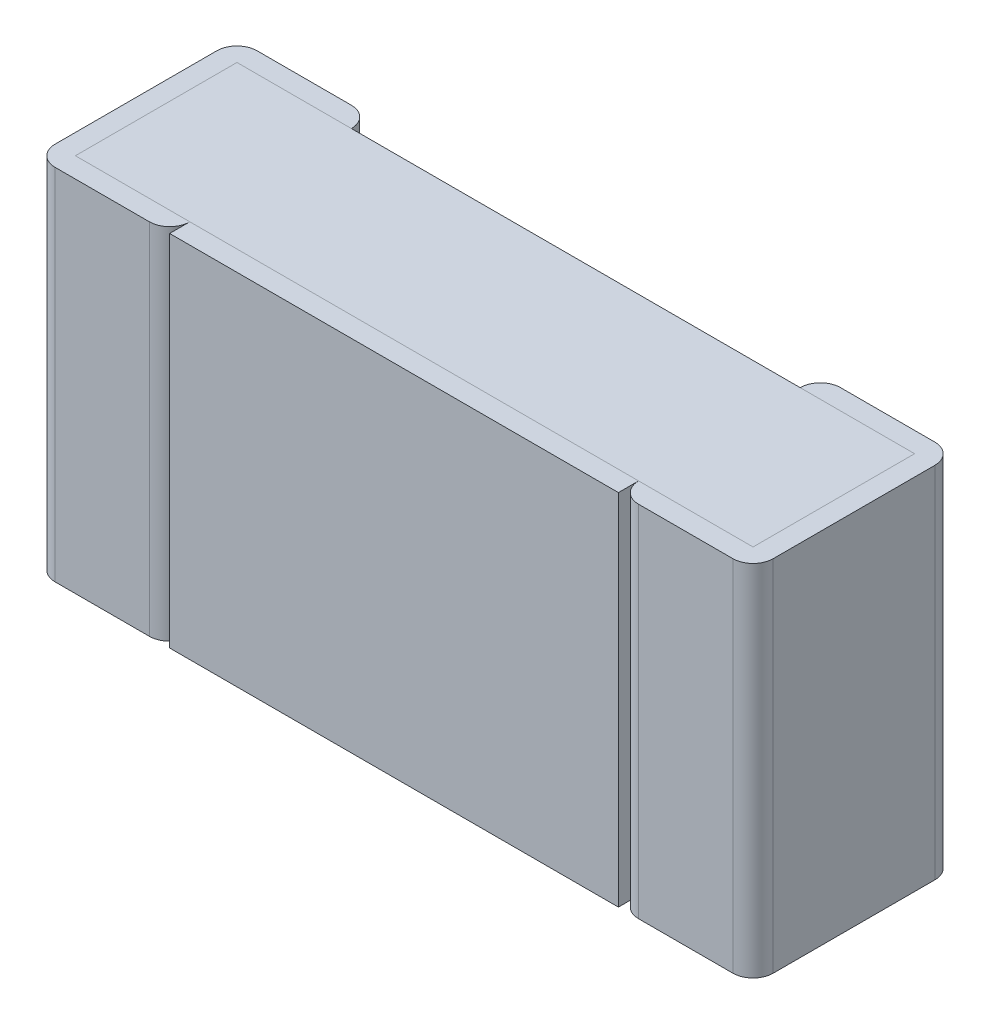
ISO-10303-21;
HEADER;
FILE_DESCRIPTION(('STEP AP214'),'2;1');
FILE_NAME('part.step','',(''),(''),'','','');
FILE_SCHEMA(('AUTOMOTIVE_DESIGN { 1 0 10303 214 1 1 1 1 }'));
ENDSEC;
DATA;
#1=APPLICATION_CONTEXT('core data for automotive mechanical design processes');
#2=APPLICATION_PROTOCOL_DEFINITION('international standard','automotive_design',2000,#1);
#3=PRODUCT_CONTEXT('',#1,'mechanical');
#4=PRODUCT('Part','Part','',(#3));
#5=PRODUCT_RELATED_PRODUCT_CATEGORY('part','',(#4));
#6=PRODUCT_DEFINITION_FORMATION('','',#4);
#7=PRODUCT_DEFINITION_CONTEXT('part definition',#1,'design');
#8=PRODUCT_DEFINITION('design','',#6,#7);
#9=PRODUCT_DEFINITION_SHAPE('','',#8);
#10=(LENGTH_UNIT() NAMED_UNIT(*) SI_UNIT(.MILLI.,.METRE.));
#11=(NAMED_UNIT(*) PLANE_ANGLE_UNIT() SI_UNIT($,.RADIAN.));
#12=(NAMED_UNIT(*) SI_UNIT($,.STERADIAN.) SOLID_ANGLE_UNIT());
#13=UNCERTAINTY_MEASURE_WITH_UNIT(LENGTH_MEASURE(1.E-05),#10,'distance_accuracy_value','');
#14=(GEOMETRIC_REPRESENTATION_CONTEXT(3) GLOBAL_UNCERTAINTY_ASSIGNED_CONTEXT((#13)) GLOBAL_UNIT_ASSIGNED_CONTEXT((#10,
#11,#12)) REPRESENTATION_CONTEXT('',''));
#15=CARTESIAN_POINT('',(0.,0.,0.));
#16=DIRECTION('',(0.,0.,1.));
#17=DIRECTION('',(1.,0.,0.));
#18=AXIS2_PLACEMENT_3D('',#15,#16,#17);
#19=CARTESIAN_POINT('',(-0.5,-0.4,0.45));
#20=DIRECTION('',(0.,0.,1.));
#21=DIRECTION('',(1.,0.,0.));
#22=AXIS2_PLACEMENT_3D('',#19,#20,#21);
#23=PLANE('',#22);
#24=DIRECTION('',(0.,1.,0.));
#25=VECTOR('',#24,1.);
#26=CARTESIAN_POINT('',(-0.5,-0.4,0.45));
#27=LINE('',#26,#25);
#28=CARTESIAN_POINT('',(-0.5,-0.4,0.45));
#29=VERTEX_POINT('',#28);
#30=CARTESIAN_POINT('',(-0.5,0.4,0.45));
#31=VERTEX_POINT('',#30);
#32=EDGE_CURVE('E294',#29,#31,#27,.T.);
#33=ORIENTED_EDGE('',*,*,#32,.F.);
#34=DIRECTION('',(1.,0.,0.));
#35=VECTOR('',#34,1.);
#36=CARTESIAN_POINT('',(-0.5,-0.4,0.45));
#37=LINE('',#36,#35);
#38=CARTESIAN_POINT('',(0.5,-0.4,0.45));
#39=VERTEX_POINT('',#38);
#40=EDGE_CURVE('E295',#29,#39,#37,.T.);
#41=ORIENTED_EDGE('',*,*,#40,.T.);
#42=DIRECTION('',(0.,1.,0.));
#43=VECTOR('',#42,1.);
#44=CARTESIAN_POINT('',(0.5,-0.4,0.45));
#45=LINE('',#44,#43);
#46=CARTESIAN_POINT('',(0.5,0.4,0.45));
#47=VERTEX_POINT('',#46);
#48=EDGE_CURVE('E11',#39,#47,#45,.T.);
#49=ORIENTED_EDGE('',*,*,#48,.T.);
#50=DIRECTION('',(1.,0.,0.));
#51=VECTOR('',#50,1.);
#52=CARTESIAN_POINT('',(-0.5,0.4,0.45));
#53=LINE('',#52,#51);
#54=EDGE_CURVE('E249',#31,#47,#53,.T.);
#55=ORIENTED_EDGE('',*,*,#54,.F.);
#56=EDGE_LOOP('',(#33,#41,#49,#55));
#57=FACE_BOUND('',#56,.T.);
#58=ADVANCED_FACE('F16',(#57),#23,.T.);
#59=CARTESIAN_POINT('',(0.5,-0.4,0.405));
#60=DIRECTION('',(1.,0.,0.));
#61=DIRECTION('',(0.,1.,0.));
#62=AXIS2_PLACEMENT_3D('',#59,#60,#61);
#63=PLANE('',#62);
#64=DIRECTION('',(0.,0.,1.));
#65=VECTOR('',#64,1.);
#66=CARTESIAN_POINT('',(0.5,-0.4,0.405));
#67=LINE('',#66,#65);
#68=CARTESIAN_POINT('',(0.5,-0.4,0.405));
#69=VERTEX_POINT('',#68);
#70=EDGE_CURVE('E279',#69,#39,#67,.T.);
#71=ORIENTED_EDGE('',*,*,#70,.F.);
#72=DIRECTION('',(0.,1.,0.));
#73=VECTOR('',#72,1.);
#74=CARTESIAN_POINT('',(0.5,-0.4,0.405));
#75=LINE('',#74,#73);
#76=CARTESIAN_POINT('',(0.5,0.4,0.405));
#77=VERTEX_POINT('',#76);
#78=EDGE_CURVE('E27',#69,#77,#75,.T.);
#79=ORIENTED_EDGE('',*,*,#78,.T.);
#80=DIRECTION('',(0.,0.,1.));
#81=VECTOR('',#80,1.);
#82=CARTESIAN_POINT('',(0.5,0.4,0.405));
#83=LINE('',#82,#81);
#84=EDGE_CURVE('E252',#77,#47,#83,.T.);
#85=ORIENTED_EDGE('',*,*,#84,.T.);
#86=ORIENTED_EDGE('',*,*,#48,.F.);
#87=EDGE_LOOP('',(#71,#79,#85,#86));
#88=FACE_BOUND('',#87,.T.);
#89=ADVANCED_FACE('F509',(#88),#63,.T.);
#90=CARTESIAN_POINT('',(0.545,-0.4,0.405));
#91=DIRECTION('',(0.,1.,0.));
#92=DIRECTION('',(-1.,0.,0.));
#93=AXIS2_PLACEMENT_3D('',#90,#91,#92);
#94=CYLINDRICAL_SURFACE('',#93,0.045);
#95=CARTESIAN_POINT('',(0.545,-0.4,0.405));
#96=DIRECTION('',(0.,1.,0.));
#97=DIRECTION('',(0.,0.,1.));
#98=AXIS2_PLACEMENT_3D('',#95,#96,#97);
#99=CIRCLE('',#98,0.045);
#100=CARTESIAN_POINT('',(0.545,-0.4,0.45));
#101=VERTEX_POINT('',#100);
#102=EDGE_CURVE('E398',#69,#101,#99,.T.);
#103=ORIENTED_EDGE('',*,*,#102,.T.);
#104=DIRECTION('',(0.,1.,0.));
#105=VECTOR('',#104,1.);
#106=CARTESIAN_POINT('',(0.545,-0.4,0.45));
#107=LINE('',#106,#105);
#108=CARTESIAN_POINT('',(0.545,0.4,0.45));
#109=VERTEX_POINT('',#108);
#110=EDGE_CURVE('E244',#101,#109,#107,.T.);
#111=ORIENTED_EDGE('',*,*,#110,.T.);
#112=CARTESIAN_POINT('',(0.545,0.4,0.405));
#113=DIRECTION('',(0.,1.,0.));
#114=DIRECTION('',(0.,0.,1.));
#115=AXIS2_PLACEMENT_3D('',#112,#113,#114);
#116=CIRCLE('',#115,0.045);
#117=EDGE_CURVE('E347',#77,#109,#116,.T.);
#118=ORIENTED_EDGE('',*,*,#117,.F.);
#119=ORIENTED_EDGE('',*,*,#78,.F.);
#120=EDGE_LOOP('',(#103,#111,#118,#119));
#121=FACE_BOUND('',#120,.T.);
#122=ADVANCED_FACE('F515',(#121),#94,.T.);
#123=CARTESIAN_POINT('',(0.5,-0.4,0.45));
#124=DIRECTION('',(0.,0.,1.));
#125=DIRECTION('',(1.,0.,0.));
#126=AXIS2_PLACEMENT_3D('',#123,#124,#125);
#127=PLANE('',#126);
#128=DIRECTION('',(1.,0.,0.));
#129=VECTOR('',#128,1.);
#130=CARTESIAN_POINT('',(0.5,0.4,0.45));
#131=LINE('',#130,#129);
#132=CARTESIAN_POINT('',(0.755,0.4,0.45));
#133=VERTEX_POINT('',#132);
#134=EDGE_CURVE('E362',#109,#133,#131,.T.);
#135=ORIENTED_EDGE('',*,*,#134,.F.);
#136=ORIENTED_EDGE('',*,*,#110,.F.);
#137=DIRECTION('',(1.,0.,0.));
#138=VECTOR('',#137,1.);
#139=CARTESIAN_POINT('',(0.5,-0.4,0.45));
#140=LINE('',#139,#138);
#141=CARTESIAN_POINT('',(0.755,-0.4,0.45));
#142=VERTEX_POINT('',#141);
#143=EDGE_CURVE('E394',#101,#142,#140,.T.);
#144=ORIENTED_EDGE('',*,*,#143,.T.);
#145=DIRECTION('',(0.,1.,0.));
#146=VECTOR('',#145,1.);
#147=CARTESIAN_POINT('',(0.755,-0.4,0.45));
#148=LINE('',#147,#146);
#149=EDGE_CURVE('E383',#142,#133,#148,.T.);
#150=ORIENTED_EDGE('',*,*,#149,.T.);
#151=EDGE_LOOP('',(#135,#136,#144,#150));
#152=FACE_BOUND('',#151,.T.);
#153=ADVANCED_FACE('F619',(#152),#127,.T.);
#154=CARTESIAN_POINT('',(0.755,-0.4,0.405));
#155=DIRECTION('',(0.,1.,0.));
#156=DIRECTION('',(1.,0.,0.));
#157=AXIS2_PLACEMENT_3D('',#154,#155,#156);
#158=CYLINDRICAL_SURFACE('',#157,0.045);
#159=DIRECTION('',(0.,1.,0.));
#160=VECTOR('',#159,1.);
#161=CARTESIAN_POINT('',(0.8,-0.4,0.405));
#162=LINE('',#161,#160);
#163=CARTESIAN_POINT('',(0.8,-0.4,0.405));
#164=VERTEX_POINT('',#163);
#165=CARTESIAN_POINT('',(0.8,0.4,0.405));
#166=VERTEX_POINT('',#165);
#167=EDGE_CURVE('E283',#164,#166,#162,.T.);
#168=ORIENTED_EDGE('',*,*,#167,.T.);
#169=CARTESIAN_POINT('',(0.755,0.4,0.405));
#170=DIRECTION('',(0.,-1.,0.));
#171=DIRECTION('',(0.,0.,1.));
#172=AXIS2_PLACEMENT_3D('',#169,#170,#171);
#173=CIRCLE('',#172,0.045);
#174=EDGE_CURVE('E275',#166,#133,#173,.T.);
#175=ORIENTED_EDGE('',*,*,#174,.T.);
#176=ORIENTED_EDGE('',*,*,#149,.F.);
#177=CARTESIAN_POINT('',(0.755,-0.4,0.405));
#178=DIRECTION('',(0.,-1.,0.));
#179=DIRECTION('',(0.,0.,1.));
#180=AXIS2_PLACEMENT_3D('',#177,#178,#179);
#181=CIRCLE('',#180,0.045);
#182=EDGE_CURVE('E327',#164,#142,#181,.T.);
#183=ORIENTED_EDGE('',*,*,#182,.F.);
#184=EDGE_LOOP('',(#168,#175,#176,#183));
#185=FACE_BOUND('',#184,.T.);
#186=ADVANCED_FACE('F614',(#185),#158,.T.);
#187=CARTESIAN_POINT('',(0.8,-0.4,0.));
#188=DIRECTION('',(1.,0.,0.));
#189=DIRECTION('',(0.,1.,0.));
#190=AXIS2_PLACEMENT_3D('',#187,#188,#189);
#191=PLANE('',#190);
#192=DIRECTION('',(0.,0.,1.));
#193=VECTOR('',#192,1.);
#194=CARTESIAN_POINT('',(0.8,-0.4,0.));
#195=LINE('',#194,#193);
#196=CARTESIAN_POINT('',(0.8,-0.4,0.045));
#197=VERTEX_POINT('',#196);
#198=EDGE_CURVE('E323',#197,#164,#195,.T.);
#199=ORIENTED_EDGE('',*,*,#198,.F.);
#200=DIRECTION('',(0.,1.,0.));
#201=VECTOR('',#200,1.);
#202=CARTESIAN_POINT('',(0.8,-0.4,0.045));
#203=LINE('',#202,#201);
#204=CARTESIAN_POINT('',(0.8,0.4,0.045));
#205=VERTEX_POINT('',#204);
#206=EDGE_CURVE('E281',#197,#205,#203,.T.);
#207=ORIENTED_EDGE('',*,*,#206,.T.);
#208=DIRECTION('',(0.,0.,1.));
#209=VECTOR('',#208,1.);
#210=CARTESIAN_POINT('',(0.8,0.4,0.));
#211=LINE('',#210,#209);
#212=EDGE_CURVE('E263',#205,#166,#211,.T.);
#213=ORIENTED_EDGE('',*,*,#212,.T.);
#214=ORIENTED_EDGE('',*,*,#167,.F.);
#215=EDGE_LOOP('',(#199,#207,#213,#214));
#216=FACE_BOUND('',#215,.T.);
#217=ADVANCED_FACE('F563',(#216),#191,.T.);
#218=CARTESIAN_POINT('',(0.755,-0.4,0.045));
#219=DIRECTION('',(0.,1.,0.));
#220=DIRECTION('',(1.,0.,0.));
#221=AXIS2_PLACEMENT_3D('',#218,#219,#220);
#222=CYLINDRICAL_SURFACE('',#221,0.045);
#223=CARTESIAN_POINT('',(0.755,-0.4,0.045));
#224=DIRECTION('',(0.,1.,0.));
#225=DIRECTION('',(0.,0.,1.));
#226=AXIS2_PLACEMENT_3D('',#223,#224,#225);
#227=CIRCLE('',#226,0.045);
#228=CARTESIAN_POINT('',(0.755,-0.4,0.));
#229=VERTEX_POINT('',#228);
#230=EDGE_CURVE('E322',#197,#229,#227,.T.);
#231=ORIENTED_EDGE('',*,*,#230,.T.);
#232=DIRECTION('',(0.,1.,0.));
#233=VECTOR('',#232,1.);
#234=CARTESIAN_POINT('',(0.755,-0.4,0.));
#235=LINE('',#234,#233);
#236=CARTESIAN_POINT('',(0.755,0.4,0.));
#237=VERTEX_POINT('',#236);
#238=EDGE_CURVE('E284',#229,#237,#235,.T.);
#239=ORIENTED_EDGE('',*,*,#238,.T.);
#240=CARTESIAN_POINT('',(0.755,0.4,0.045));
#241=DIRECTION('',(0.,1.,0.));
#242=DIRECTION('',(0.,0.,1.));
#243=AXIS2_PLACEMENT_3D('',#240,#241,#242);
#244=CIRCLE('',#243,0.045);
#245=EDGE_CURVE('E253',#205,#237,#244,.T.);
#246=ORIENTED_EDGE('',*,*,#245,.F.);
#247=ORIENTED_EDGE('',*,*,#206,.F.);
#248=EDGE_LOOP('',(#231,#239,#246,#247));
#249=FACE_BOUND('',#248,.T.);
#250=ADVANCED_FACE('F558',(#249),#222,.T.);
#251=CARTESIAN_POINT('',(0.5,-0.4,0.));
#252=DIRECTION('',(0.,0.,1.));
#253=DIRECTION('',(1.,0.,0.));
#254=AXIS2_PLACEMENT_3D('',#251,#252,#253);
#255=PLANE('',#254);
#256=ORIENTED_EDGE('',*,*,#238,.F.);
#257=DIRECTION('',(1.,0.,0.));
#258=VECTOR('',#257,1.);
#259=CARTESIAN_POINT('',(0.5,-0.4,0.));
#260=LINE('',#259,#258);
#261=CARTESIAN_POINT('',(0.545,-0.4,0.));
#262=VERTEX_POINT('',#261);
#263=EDGE_CURVE('E378',#262,#229,#260,.T.);
#264=ORIENTED_EDGE('',*,*,#263,.F.);
#265=DIRECTION('',(0.,1.,0.));
#266=VECTOR('',#265,1.);
#267=CARTESIAN_POINT('',(0.545,-0.4,0.));
#268=LINE('',#267,#266);
#269=CARTESIAN_POINT('',(0.545,0.4,0.));
#270=VERTEX_POINT('',#269);
#271=EDGE_CURVE('E260',#262,#270,#268,.T.);
#272=ORIENTED_EDGE('',*,*,#271,.T.);
#273=DIRECTION('',(1.,0.,0.));
#274=VECTOR('',#273,1.);
#275=CARTESIAN_POINT('',(0.5,0.4,0.));
#276=LINE('',#275,#274);
#277=EDGE_CURVE('E317',#270,#237,#276,.T.);
#278=ORIENTED_EDGE('',*,*,#277,.T.);
#279=EDGE_LOOP('',(#256,#264,#272,#278));
#280=FACE_BOUND('',#279,.T.);
#281=ADVANCED_FACE('F540',(#280),#255,.F.);
#282=CARTESIAN_POINT('',(0.545,-0.4,0.045));
#283=DIRECTION('',(0.,1.,0.));
#284=DIRECTION('',(-1.,0.,0.));
#285=AXIS2_PLACEMENT_3D('',#282,#283,#284);
#286=CYLINDRICAL_SURFACE('',#285,0.045);
#287=DIRECTION('',(0.,1.,0.));
#288=VECTOR('',#287,1.);
#289=CARTESIAN_POINT('',(0.5,-0.4,0.045));
#290=LINE('',#289,#288);
#291=CARTESIAN_POINT('',(0.5,-0.4,0.045));
#292=VERTEX_POINT('',#291);
#293=CARTESIAN_POINT('',(0.5,0.4,0.045));
#294=VERTEX_POINT('',#293);
#295=EDGE_CURVE('E318',#292,#294,#290,.T.);
#296=ORIENTED_EDGE('',*,*,#295,.T.);
#297=CARTESIAN_POINT('',(0.545,0.4,0.045));
#298=DIRECTION('',(0.,-1.,0.));
#299=DIRECTION('',(0.,0.,1.));
#300=AXIS2_PLACEMENT_3D('',#297,#298,#299);
#301=CIRCLE('',#300,0.045);
#302=EDGE_CURVE('E343',#294,#270,#301,.T.);
#303=ORIENTED_EDGE('',*,*,#302,.T.);
#304=ORIENTED_EDGE('',*,*,#271,.F.);
#305=CARTESIAN_POINT('',(0.545,-0.4,0.045));
#306=DIRECTION('',(0.,-1.,0.));
#307=DIRECTION('',(0.,0.,1.));
#308=AXIS2_PLACEMENT_3D('',#305,#306,#307);
#309=CIRCLE('',#308,0.045);
#310=EDGE_CURVE('E382',#292,#262,#309,.T.);
#311=ORIENTED_EDGE('',*,*,#310,.F.);
#312=EDGE_LOOP('',(#296,#303,#304,#311));
#313=FACE_BOUND('',#312,.T.);
#314=ADVANCED_FACE('F535',(#313),#286,.T.);
#315=CARTESIAN_POINT('',(-0.5,0.4,0.405));
#316=DIRECTION('',(0.,1.,0.));
#317=DIRECTION('',(1.,0.,0.));
#318=AXIS2_PLACEMENT_3D('',#315,#316,#317);
#319=PLANE('',#318);
#320=DIRECTION('',(1.,0.,0.));
#321=VECTOR('',#320,1.);
#322=CARTESIAN_POINT('',(-0.5,0.4,0.405));
#323=LINE('',#322,#321);
#324=CARTESIAN_POINT('',(-0.5,0.4,0.405));
#325=VERTEX_POINT('',#324);
#326=EDGE_CURVE('E20',#325,#77,#323,.T.);
#327=ORIENTED_EDGE('',*,*,#326,.F.);
#328=DIRECTION('',(0.,0.,1.));
#329=VECTOR('',#328,1.);
#330=CARTESIAN_POINT('',(-0.5,0.4,0.405));
#331=LINE('',#330,#329);
#332=EDGE_CURVE('E314',#325,#31,#331,.T.);
#333=ORIENTED_EDGE('',*,*,#332,.T.);
#334=ORIENTED_EDGE('',*,*,#54,.T.);
#335=ORIENTED_EDGE('',*,*,#84,.F.);
#336=EDGE_LOOP('',(#327,#333,#334,#335));
#337=FACE_BOUND('',#336,.T.);
#338=ADVANCED_FACE('F484',(#337),#319,.T.);
#339=CARTESIAN_POINT('',(0.5,0.4,0.));
#340=DIRECTION('',(0.,1.,0.));
#341=DIRECTION('',(1.,0.,0.));
#342=AXIS2_PLACEMENT_3D('',#339,#340,#341);
#343=PLANE('',#342);
#344=ORIENTED_EDGE('',*,*,#277,.F.);
#345=ORIENTED_EDGE('',*,*,#302,.F.);
#346=DIRECTION('',(1.,0.,0.));
#347=VECTOR('',#346,1.);
#348=CARTESIAN_POINT('',(-0.755,0.4,0.045));
#349=LINE('',#348,#347);
#350=CARTESIAN_POINT('',(0.755,0.4,0.045));
#351=VERTEX_POINT('',#350);
#352=EDGE_CURVE('E235',#294,#351,#349,.T.);
#353=ORIENTED_EDGE('',*,*,#352,.T.);
#354=DIRECTION('',(0.,0.,1.));
#355=VECTOR('',#354,1.);
#356=CARTESIAN_POINT('',(0.755,0.4,0.045));
#357=LINE('',#356,#355);
#358=CARTESIAN_POINT('',(0.755,0.4,0.405));
#359=VERTEX_POINT('',#358);
#360=EDGE_CURVE('E390',#351,#359,#357,.T.);
#361=ORIENTED_EDGE('',*,*,#360,.T.);
#362=DIRECTION('',(1.,0.,0.));
#363=VECTOR('',#362,1.);
#364=CARTESIAN_POINT('',(-0.755,0.4,0.405));
#365=LINE('',#364,#363);
#366=EDGE_CURVE('E386',#77,#359,#365,.T.);
#367=ORIENTED_EDGE('',*,*,#366,.F.);
#368=ORIENTED_EDGE('',*,*,#117,.T.);
#369=ORIENTED_EDGE('',*,*,#134,.T.);
#370=ORIENTED_EDGE('',*,*,#174,.F.);
#371=ORIENTED_EDGE('',*,*,#212,.F.);
#372=ORIENTED_EDGE('',*,*,#245,.T.);
#373=EDGE_LOOP('',(#344,#345,#353,#361,#367,#368,#369,#370,#371,#372));
#374=FACE_BOUND('',#373,.T.);
#375=ADVANCED_FACE('F517',(#374),#343,.T.);
#376=CARTESIAN_POINT('',(-0.5,-0.4,0.405));
#377=DIRECTION('',(1.,0.,0.));
#378=DIRECTION('',(0.,1.,0.));
#379=AXIS2_PLACEMENT_3D('',#376,#377,#378);
#380=PLANE('',#379);
#381=ORIENTED_EDGE('',*,*,#32,.T.);
#382=ORIENTED_EDGE('',*,*,#332,.F.);
#383=DIRECTION('',(0.,1.,0.));
#384=VECTOR('',#383,1.);
#385=CARTESIAN_POINT('',(-0.5,-0.4,0.405));
#386=LINE('',#385,#384);
#387=CARTESIAN_POINT('',(-0.5,-0.4,0.405));
#388=VERTEX_POINT('',#387);
#389=EDGE_CURVE('E285',#388,#325,#386,.T.);
#390=ORIENTED_EDGE('',*,*,#389,.F.);
#391=DIRECTION('',(0.,0.,1.));
#392=VECTOR('',#391,1.);
#393=CARTESIAN_POINT('',(-0.5,-0.4,0.405));
#394=LINE('',#393,#392);
#395=EDGE_CURVE('E290',#388,#29,#394,.T.);
#396=ORIENTED_EDGE('',*,*,#395,.T.);
#397=EDGE_LOOP('',(#381,#382,#390,#396));
#398=FACE_BOUND('',#397,.T.);
#399=ADVANCED_FACE('F479',(#398),#380,.F.);
#400=CARTESIAN_POINT('',(-0.5,-0.4,0.405));
#401=DIRECTION('',(0.,1.,0.));
#402=DIRECTION('',(1.,0.,0.));
#403=AXIS2_PLACEMENT_3D('',#400,#401,#402);
#404=PLANE('',#403);
#405=ORIENTED_EDGE('',*,*,#70,.T.);
#406=ORIENTED_EDGE('',*,*,#40,.F.);
#407=ORIENTED_EDGE('',*,*,#395,.F.);
#408=DIRECTION('',(1.,0.,0.));
#409=VECTOR('',#408,1.);
#410=CARTESIAN_POINT('',(-0.5,-0.4,0.405));
#411=LINE('',#410,#409);
#412=EDGE_CURVE('E335',#388,#69,#411,.T.);
#413=ORIENTED_EDGE('',*,*,#412,.T.);
#414=EDGE_LOOP('',(#405,#406,#407,#413));
#415=FACE_BOUND('',#414,.T.);
#416=ADVANCED_FACE('F502',(#415),#404,.F.);
#417=CARTESIAN_POINT('',(0.5,-0.4,0.));
#418=DIRECTION('',(0.,1.,0.));
#419=DIRECTION('',(1.,0.,0.));
#420=AXIS2_PLACEMENT_3D('',#417,#418,#419);
#421=PLANE('',#420);
#422=ORIENTED_EDGE('',*,*,#230,.F.);
#423=ORIENTED_EDGE('',*,*,#198,.T.);
#424=ORIENTED_EDGE('',*,*,#182,.T.);
#425=ORIENTED_EDGE('',*,*,#143,.F.);
#426=ORIENTED_EDGE('',*,*,#102,.F.);
#427=DIRECTION('',(1.,0.,0.));
#428=VECTOR('',#427,1.);
#429=CARTESIAN_POINT('',(-0.755,-0.4,0.405));
#430=LINE('',#429,#428);
#431=CARTESIAN_POINT('',(0.755,-0.4,0.405));
#432=VERTEX_POINT('',#431);
#433=EDGE_CURVE('E332',#69,#432,#430,.T.);
#434=ORIENTED_EDGE('',*,*,#433,.T.);
#435=DIRECTION('',(0.,0.,1.));
#436=VECTOR('',#435,1.);
#437=CARTESIAN_POINT('',(0.755,-0.4,0.045));
#438=LINE('',#437,#436);
#439=CARTESIAN_POINT('',(0.755,-0.4,0.045));
#440=VERTEX_POINT('',#439);
#441=EDGE_CURVE('E336',#440,#432,#438,.T.);
#442=ORIENTED_EDGE('',*,*,#441,.F.);
#443=DIRECTION('',(1.,0.,0.));
#444=VECTOR('',#443,1.);
#445=CARTESIAN_POINT('',(-0.755,-0.4,0.045));
#446=LINE('',#445,#444);
#447=EDGE_CURVE('E357',#292,#440,#446,.T.);
#448=ORIENTED_EDGE('',*,*,#447,.F.);
#449=ORIENTED_EDGE('',*,*,#310,.T.);
#450=ORIENTED_EDGE('',*,*,#263,.T.);
#451=EDGE_LOOP('',(#422,#423,#424,#425,#426,#434,#442,#448,#449,#450));
#452=FACE_BOUND('',#451,.T.);
#453=ADVANCED_FACE('F513',(#452),#421,.F.);
#454=CARTESIAN_POINT('',(-0.755,-0.4,0.045));
#455=DIRECTION('',(0.,0.,1.));
#456=DIRECTION('',(1.,0.,0.));
#457=AXIS2_PLACEMENT_3D('',#454,#455,#456);
#458=PLANE('',#457);
#459=DIRECTION('',(1.,0.,0.));
#460=VECTOR('',#459,1.);
#461=CARTESIAN_POINT('',(-0.755,0.4,0.045));
#462=LINE('',#461,#460);
#463=CARTESIAN_POINT('',(-0.5,0.4,0.045));
#464=VERTEX_POINT('',#463);
#465=EDGE_CURVE('E215',#464,#294,#462,.T.);
#466=ORIENTED_EDGE('',*,*,#465,.T.);
#467=ORIENTED_EDGE('',*,*,#295,.F.);
#468=DIRECTION('',(1.,0.,0.));
#469=VECTOR('',#468,1.);
#470=CARTESIAN_POINT('',(-0.755,-0.4,0.045));
#471=LINE('',#470,#469);
#472=CARTESIAN_POINT('',(-0.5,-0.4,0.045));
#473=VERTEX_POINT('',#472);
#474=EDGE_CURVE('E353',#473,#292,#471,.T.);
#475=ORIENTED_EDGE('',*,*,#474,.F.);
#476=DIRECTION('',(0.,1.,0.));
#477=VECTOR('',#476,1.);
#478=CARTESIAN_POINT('',(-0.5,-0.4,0.045));
#479=LINE('',#478,#477);
#480=EDGE_CURVE('E358',#473,#464,#479,.T.);
#481=ORIENTED_EDGE('',*,*,#480,.T.);
#482=EDGE_LOOP('',(#466,#467,#475,#481));
#483=FACE_BOUND('',#482,.T.);
#484=ADVANCED_FACE('F587',(#483),#458,.F.);
#485=CARTESIAN_POINT('',(-0.755,0.4,0.045));
#486=DIRECTION('',(0.,1.,0.));
#487=DIRECTION('',(1.,0.,0.));
#488=AXIS2_PLACEMENT_3D('',#485,#486,#487);
#489=PLANE('',#488);
#490=DIRECTION('',(1.,0.,0.));
#491=VECTOR('',#490,1.);
#492=CARTESIAN_POINT('',(-0.755,0.4,0.045));
#493=LINE('',#492,#491);
#494=CARTESIAN_POINT('',(-0.755,0.4,0.045));
#495=VERTEX_POINT('',#494);
#496=EDGE_CURVE('E207',#495,#464,#493,.T.);
#497=ORIENTED_EDGE('',*,*,#496,.F.);
#498=DIRECTION('',(0.,0.,1.));
#499=VECTOR('',#498,1.);
#500=CARTESIAN_POINT('',(-0.755,0.4,0.045));
#501=LINE('',#500,#499);
#502=CARTESIAN_POINT('',(-0.755,0.4,0.405));
#503=VERTEX_POINT('',#502);
#504=EDGE_CURVE('E211',#495,#503,#501,.T.);
#505=ORIENTED_EDGE('',*,*,#504,.T.);
#506=DIRECTION('',(1.,0.,0.));
#507=VECTOR('',#506,1.);
#508=CARTESIAN_POINT('',(-0.755,0.4,0.405));
#509=LINE('',#508,#507);
#510=EDGE_CURVE('E224',#503,#325,#509,.T.);
#511=ORIENTED_EDGE('',*,*,#510,.T.);
#512=ORIENTED_EDGE('',*,*,#326,.T.);
#513=ORIENTED_EDGE('',*,*,#366,.T.);
#514=ORIENTED_EDGE('',*,*,#360,.F.);
#515=ORIENTED_EDGE('',*,*,#352,.F.);
#516=ORIENTED_EDGE('',*,*,#465,.F.);
#517=EDGE_LOOP('',(#497,#505,#511,#512,#513,#514,#515,#516));
#518=FACE_BOUND('',#517,.T.);
#519=ADVANCED_FACE('F209',(#518),#489,.T.);
#520=CARTESIAN_POINT('',(-0.545,-0.4,0.405));
#521=DIRECTION('',(0.,1.,0.));
#522=DIRECTION('',(1.,0.,0.));
#523=AXIS2_PLACEMENT_3D('',#520,#521,#522);
#524=CYLINDRICAL_SURFACE('',#523,0.045);
#525=ORIENTED_EDGE('',*,*,#389,.T.);
#526=CARTESIAN_POINT('',(-0.545,0.4,0.405));
#527=DIRECTION('',(0.,-1.,0.));
#528=DIRECTION('',(0.,0.,1.));
#529=AXIS2_PLACEMENT_3D('',#526,#527,#528);
#530=CIRCLE('',#529,0.045);
#531=CARTESIAN_POINT('',(-0.545,0.4,0.45));
#532=VERTEX_POINT('',#531);
#533=EDGE_CURVE('E231',#325,#532,#530,.T.);
#534=ORIENTED_EDGE('',*,*,#533,.T.);
#535=DIRECTION('',(0.,1.,0.));
#536=VECTOR('',#535,1.);
#537=CARTESIAN_POINT('',(-0.545,-0.4,0.45));
#538=LINE('',#537,#536);
#539=CARTESIAN_POINT('',(-0.545,-0.4,0.45));
#540=VERTEX_POINT('',#539);
#541=EDGE_CURVE('E289',#540,#532,#538,.T.);
#542=ORIENTED_EDGE('',*,*,#541,.F.);
#543=CARTESIAN_POINT('',(-0.545,-0.4,0.405));
#544=DIRECTION('',(0.,-1.,0.));
#545=DIRECTION('',(0.,0.,1.));
#546=AXIS2_PLACEMENT_3D('',#543,#544,#545);
#547=CIRCLE('',#546,0.045);
#548=EDGE_CURVE('E331',#388,#540,#547,.T.);
#549=ORIENTED_EDGE('',*,*,#548,.F.);
#550=EDGE_LOOP('',(#525,#534,#542,#549));
#551=FACE_BOUND('',#550,.T.);
#552=ADVANCED_FACE('F489',(#551),#524,.T.);
#553=CARTESIAN_POINT('',(-0.8,-0.4,0.45));
#554=DIRECTION('',(0.,0.,1.));
#555=DIRECTION('',(1.,0.,0.));
#556=AXIS2_PLACEMENT_3D('',#553,#554,#555);
#557=PLANE('',#556);
#558=DIRECTION('',(1.,0.,0.));
#559=VECTOR('',#558,1.);
#560=CARTESIAN_POINT('',(-0.8,0.4,0.45));
#561=LINE('',#560,#559);
#562=CARTESIAN_POINT('',(-0.755,0.4,0.45));
#563=VERTEX_POINT('',#562);
#564=EDGE_CURVE('E310',#563,#532,#561,.T.);
#565=ORIENTED_EDGE('',*,*,#564,.F.);
#566=DIRECTION('',(0.,1.,0.));
#567=VECTOR('',#566,1.);
#568=CARTESIAN_POINT('',(-0.755,-0.4,0.45));
#569=LINE('',#568,#567);
#570=CARTESIAN_POINT('',(-0.755,-0.4,0.45));
#571=VERTEX_POINT('',#570);
#572=EDGE_CURVE('E342',#571,#563,#569,.T.);
#573=ORIENTED_EDGE('',*,*,#572,.F.);
#574=DIRECTION('',(1.,0.,0.));
#575=VECTOR('',#574,1.);
#576=CARTESIAN_POINT('',(-0.8,-0.4,0.45));
#577=LINE('',#576,#575);
#578=EDGE_CURVE('E373',#571,#540,#577,.T.);
#579=ORIENTED_EDGE('',*,*,#578,.T.);
#580=ORIENTED_EDGE('',*,*,#541,.T.);
#581=EDGE_LOOP('',(#565,#573,#579,#580));
#582=FACE_BOUND('',#581,.T.);
#583=ADVANCED_FACE('F492',(#582),#557,.T.);
#584=CARTESIAN_POINT('',(-0.755,-0.4,0.045));
#585=DIRECTION('',(0.,1.,0.));
#586=DIRECTION('',(1.,0.,0.));
#587=AXIS2_PLACEMENT_3D('',#584,#585,#586);
#588=PLANE('',#587);
#589=ORIENTED_EDGE('',*,*,#474,.T.);
#590=ORIENTED_EDGE('',*,*,#447,.T.);
#591=ORIENTED_EDGE('',*,*,#441,.T.);
#592=ORIENTED_EDGE('',*,*,#433,.F.);
#593=ORIENTED_EDGE('',*,*,#412,.F.);
#594=DIRECTION('',(1.,0.,0.));
#595=VECTOR('',#594,1.);
#596=CARTESIAN_POINT('',(-0.755,-0.4,0.405));
#597=LINE('',#596,#595);
#598=CARTESIAN_POINT('',(-0.755,-0.4,0.405));
#599=VERTEX_POINT('',#598);
#600=EDGE_CURVE('E248',#599,#388,#597,.T.);
#601=ORIENTED_EDGE('',*,*,#600,.F.);
#602=DIRECTION('',(0.,0.,1.));
#603=VECTOR('',#602,1.);
#604=CARTESIAN_POINT('',(-0.755,-0.4,0.045));
#605=LINE('',#604,#603);
#606=CARTESIAN_POINT('',(-0.755,-0.4,0.045));
#607=VERTEX_POINT('',#606);
#608=EDGE_CURVE('E245',#607,#599,#605,.T.);
#609=ORIENTED_EDGE('',*,*,#608,.F.);
#610=DIRECTION('',(1.,0.,0.));
#611=VECTOR('',#610,1.);
#612=CARTESIAN_POINT('',(-0.755,-0.4,0.045));
#613=LINE('',#612,#611);
#614=EDGE_CURVE('E240',#607,#473,#613,.T.);
#615=ORIENTED_EDGE('',*,*,#614,.T.);
#616=EDGE_LOOP('',(#589,#590,#591,#592,#593,#601,#609,#615));
#617=FACE_BOUND('',#616,.T.);
#618=ADVANCED_FACE('F499',(#617),#588,.F.);
#619=CARTESIAN_POINT('',(-0.545,-0.4,0.045));
#620=DIRECTION('',(0.,1.,0.));
#621=DIRECTION('',(1.,0.,0.));
#622=AXIS2_PLACEMENT_3D('',#619,#620,#621);
#623=CYLINDRICAL_SURFACE('',#622,0.045);
#624=CARTESIAN_POINT('',(-0.545,-0.4,0.045));
#625=DIRECTION('',(0.,1.,0.));
#626=DIRECTION('',(0.,0.,1.));
#627=AXIS2_PLACEMENT_3D('',#624,#625,#626);
#628=CIRCLE('',#627,0.045);
#629=CARTESIAN_POINT('',(-0.545,-0.4,0.));
#630=VERTEX_POINT('',#629);
#631=EDGE_CURVE('E237',#473,#630,#628,.T.);
#632=ORIENTED_EDGE('',*,*,#631,.T.);
#633=DIRECTION('',(0.,1.,0.));
#634=VECTOR('',#633,1.);
#635=CARTESIAN_POINT('',(-0.545,-0.4,0.));
#636=LINE('',#635,#634);
#637=CARTESIAN_POINT('',(-0.545,0.4,0.));
#638=VERTEX_POINT('',#637);
#639=EDGE_CURVE('E391',#630,#638,#636,.T.);
#640=ORIENTED_EDGE('',*,*,#639,.T.);
#641=CARTESIAN_POINT('',(-0.545,0.4,0.045));
#642=DIRECTION('',(0.,1.,0.));
#643=DIRECTION('',(0.,0.,1.));
#644=AXIS2_PLACEMENT_3D('',#641,#642,#643);
#645=CIRCLE('',#644,0.045);
#646=EDGE_CURVE('E220',#464,#638,#645,.T.);
#647=ORIENTED_EDGE('',*,*,#646,.F.);
#648=ORIENTED_EDGE('',*,*,#480,.F.);
#649=EDGE_LOOP('',(#632,#640,#647,#648));
#650=FACE_BOUND('',#649,.T.);
#651=ADVANCED_FACE('F525',(#650),#623,.T.);
#652=CARTESIAN_POINT('',(-0.8,-0.4,0.));
#653=DIRECTION('',(0.,0.,1.));
#654=DIRECTION('',(1.,0.,0.));
#655=AXIS2_PLACEMENT_3D('',#652,#653,#654);
#656=PLANE('',#655);
#657=ORIENTED_EDGE('',*,*,#639,.F.);
#658=DIRECTION('',(1.,0.,0.));
#659=VECTOR('',#658,1.);
#660=CARTESIAN_POINT('',(-0.8,-0.4,0.));
#661=LINE('',#660,#659);
#662=CARTESIAN_POINT('',(-0.755,-0.4,0.));
#663=VERTEX_POINT('',#662);
#664=EDGE_CURVE('E365',#663,#630,#661,.T.);
#665=ORIENTED_EDGE('',*,*,#664,.F.);
#666=DIRECTION('',(0.,1.,0.));
#667=VECTOR('',#666,1.);
#668=CARTESIAN_POINT('',(-0.755,-0.4,0.));
#669=LINE('',#668,#667);
#670=CARTESIAN_POINT('',(-0.755,0.4,0.));
#671=VERTEX_POINT('',#670);
#672=EDGE_CURVE('E348',#663,#671,#669,.T.);
#673=ORIENTED_EDGE('',*,*,#672,.T.);
#674=DIRECTION('',(1.,0.,0.));
#675=VECTOR('',#674,1.);
#676=CARTESIAN_POINT('',(-0.8,0.4,0.));
#677=LINE('',#676,#675);
#678=EDGE_CURVE('E341',#671,#638,#677,.T.);
#679=ORIENTED_EDGE('',*,*,#678,.T.);
#680=EDGE_LOOP('',(#657,#665,#673,#679));
#681=FACE_BOUND('',#680,.T.);
#682=ADVANCED_FACE('F18',(#681),#656,.F.);
#683=CARTESIAN_POINT('',(-0.8,0.4,0.));
#684=DIRECTION('',(0.,1.,0.));
#685=DIRECTION('',(1.,0.,0.));
#686=AXIS2_PLACEMENT_3D('',#683,#684,#685);
#687=PLANE('',#686);
#688=ORIENTED_EDGE('',*,*,#678,.F.);
#689=CARTESIAN_POINT('',(-0.755,0.4,0.045));
#690=DIRECTION('',(0.,-1.,0.));
#691=DIRECTION('',(0.,0.,1.));
#692=AXIS2_PLACEMENT_3D('',#689,#690,#691);
#693=CIRCLE('',#692,0.045);
#694=CARTESIAN_POINT('',(-0.8,0.4,0.045));
#695=VERTEX_POINT('',#694);
#696=EDGE_CURVE('E352',#695,#671,#693,.T.);
#697=ORIENTED_EDGE('',*,*,#696,.F.);
#698=DIRECTION('',(0.,0.,1.));
#699=VECTOR('',#698,1.);
#700=CARTESIAN_POINT('',(-0.8,0.4,0.));
#701=LINE('',#700,#699);
#702=CARTESIAN_POINT('',(-0.8,0.4,0.405));
#703=VERTEX_POINT('',#702);
#704=EDGE_CURVE('E298',#695,#703,#701,.T.);
#705=ORIENTED_EDGE('',*,*,#704,.T.);
#706=CARTESIAN_POINT('',(-0.755,0.4,0.405));
#707=DIRECTION('',(0.,1.,0.));
#708=DIRECTION('',(0.,0.,1.));
#709=AXIS2_PLACEMENT_3D('',#706,#707,#708);
#710=CIRCLE('',#709,0.045);
#711=EDGE_CURVE('E337',#703,#563,#710,.T.);
#712=ORIENTED_EDGE('',*,*,#711,.T.);
#713=ORIENTED_EDGE('',*,*,#564,.T.);
#714=ORIENTED_EDGE('',*,*,#533,.F.);
#715=ORIENTED_EDGE('',*,*,#510,.F.);
#716=ORIENTED_EDGE('',*,*,#504,.F.);
#717=ORIENTED_EDGE('',*,*,#496,.T.);
#718=ORIENTED_EDGE('',*,*,#646,.T.);
#719=EDGE_LOOP('',(#688,#697,#705,#712,#713,#714,#715,#716,#717,#718));
#720=FACE_BOUND('',#719,.T.);
#721=ADVANCED_FACE('F222',(#720),#687,.T.);
#722=CARTESIAN_POINT('',(-0.755,-0.4,0.405));
#723=DIRECTION('',(0.,1.,0.));
#724=DIRECTION('',(-1.,0.,0.));
#725=AXIS2_PLACEMENT_3D('',#722,#723,#724);
#726=CYLINDRICAL_SURFACE('',#725,0.045);
#727=CARTESIAN_POINT('',(-0.755,-0.4,0.405));
#728=DIRECTION('',(0.,1.,0.));
#729=DIRECTION('',(0.,0.,1.));
#730=AXIS2_PLACEMENT_3D('',#727,#728,#729);
#731=CIRCLE('',#730,0.045);
#732=CARTESIAN_POINT('',(-0.8,-0.4,0.405));
#733=VERTEX_POINT('',#732);
#734=EDGE_CURVE('E377',#733,#571,#731,.T.);
#735=ORIENTED_EDGE('',*,*,#734,.T.);
#736=ORIENTED_EDGE('',*,*,#572,.T.);
#737=ORIENTED_EDGE('',*,*,#711,.F.);
#738=DIRECTION('',(0.,1.,0.));
#739=VECTOR('',#738,1.);
#740=CARTESIAN_POINT('',(-0.8,-0.4,0.405));
#741=LINE('',#740,#739);
#742=EDGE_CURVE('E303',#733,#703,#741,.T.);
#743=ORIENTED_EDGE('',*,*,#742,.F.);
#744=EDGE_LOOP('',(#735,#736,#737,#743));
#745=FACE_BOUND('',#744,.T.);
#746=ADVANCED_FACE('F687',(#745),#726,.T.);
#747=CARTESIAN_POINT('',(-0.755,-0.4,0.045));
#748=DIRECTION('',(0.,1.,0.));
#749=DIRECTION('',(-1.,0.,0.));
#750=AXIS2_PLACEMENT_3D('',#747,#748,#749);
#751=CYLINDRICAL_SURFACE('',#750,0.045);
#752=DIRECTION('',(0.,1.,0.));
#753=VECTOR('',#752,1.);
#754=CARTESIAN_POINT('',(-0.8,-0.4,0.045));
#755=LINE('',#754,#753);
#756=CARTESIAN_POINT('',(-0.8,-0.4,0.045));
#757=VERTEX_POINT('',#756);
#758=EDGE_CURVE('E302',#757,#695,#755,.T.);
#759=ORIENTED_EDGE('',*,*,#758,.T.);
#760=ORIENTED_EDGE('',*,*,#696,.T.);
#761=ORIENTED_EDGE('',*,*,#672,.F.);
#762=CARTESIAN_POINT('',(-0.755,-0.4,0.045));
#763=DIRECTION('',(0.,-1.,0.));
#764=DIRECTION('',(0.,0.,1.));
#765=AXIS2_PLACEMENT_3D('',#762,#763,#764);
#766=CIRCLE('',#765,0.045);
#767=EDGE_CURVE('E402',#757,#663,#766,.T.);
#768=ORIENTED_EDGE('',*,*,#767,.F.);
#769=EDGE_LOOP('',(#759,#760,#761,#768));
#770=FACE_BOUND('',#769,.T.);
#771=ADVANCED_FACE('F649',(#770),#751,.T.);
#772=CARTESIAN_POINT('',(-0.8,-0.4,0.));
#773=DIRECTION('',(0.,1.,0.));
#774=DIRECTION('',(1.,0.,0.));
#775=AXIS2_PLACEMENT_3D('',#772,#773,#774);
#776=PLANE('',#775);
#777=ORIENTED_EDGE('',*,*,#631,.F.);
#778=ORIENTED_EDGE('',*,*,#614,.F.);
#779=ORIENTED_EDGE('',*,*,#608,.T.);
#780=ORIENTED_EDGE('',*,*,#600,.T.);
#781=ORIENTED_EDGE('',*,*,#548,.T.);
#782=ORIENTED_EDGE('',*,*,#578,.F.);
#783=ORIENTED_EDGE('',*,*,#734,.F.);
#784=DIRECTION('',(0.,0.,1.));
#785=VECTOR('',#784,1.);
#786=CARTESIAN_POINT('',(-0.8,-0.4,0.));
#787=LINE('',#786,#785);
#788=EDGE_CURVE('E241',#757,#733,#787,.T.);
#789=ORIENTED_EDGE('',*,*,#788,.F.);
#790=ORIENTED_EDGE('',*,*,#767,.T.);
#791=ORIENTED_EDGE('',*,*,#664,.T.);
#792=EDGE_LOOP('',(#777,#778,#779,#780,#781,#782,#783,#789,#790,#791));
#793=FACE_BOUND('',#792,.T.);
#794=ADVANCED_FACE('F496',(#793),#776,.F.);
#795=CARTESIAN_POINT('',(-0.8,-0.4,0.));
#796=DIRECTION('',(1.,0.,0.));
#797=DIRECTION('',(0.,1.,0.));
#798=AXIS2_PLACEMENT_3D('',#795,#796,#797);
#799=PLANE('',#798);
#800=ORIENTED_EDGE('',*,*,#742,.T.);
#801=ORIENTED_EDGE('',*,*,#704,.F.);
#802=ORIENTED_EDGE('',*,*,#758,.F.);
#803=ORIENTED_EDGE('',*,*,#788,.T.);
#804=EDGE_LOOP('',(#800,#801,#802,#803));
#805=FACE_BOUND('',#804,.T.);
#806=ADVANCED_FACE('F648',(#805),#799,.F.);
#807=CLOSED_SHELL('',(#58,#89,#122,#153,#186,#217,#250,#281,#314,#338,#375,#399,#416,#453,#484,
#519,#552,#583,#618,#651,#682,#721,#746,#771,#794,#806));
#808=MANIFOLD_SOLID_BREP('B1',#807);
#809=ADVANCED_BREP_SHAPE_REPRESENTATION('',(#18,#808),#14);
#810=SHAPE_DEFINITION_REPRESENTATION(#9,#809);
ENDSEC;
END-ISO-10303-21;
